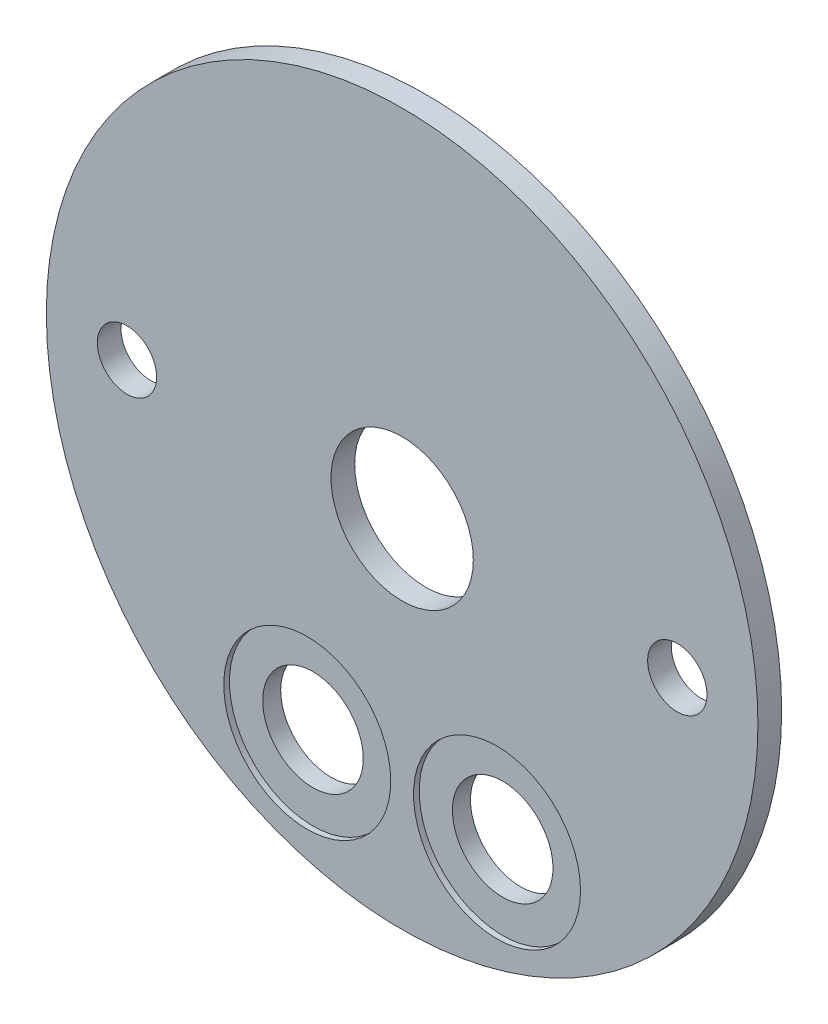
ISO-10303-21;
HEADER;
FILE_DESCRIPTION(('STEP AP214'),'2;1');
FILE_NAME('part.step','',(''),(''),'','','');
FILE_SCHEMA(('AUTOMOTIVE_DESIGN { 1 0 10303 214 1 1 1 1 }'));
ENDSEC;
DATA;
#1=APPLICATION_CONTEXT('core data for automotive mechanical design processes');
#2=APPLICATION_PROTOCOL_DEFINITION('international standard','automotive_design',2000,#1);
#3=PRODUCT_CONTEXT('',#1,'mechanical');
#4=PRODUCT('Part','Part','',(#3));
#5=PRODUCT_RELATED_PRODUCT_CATEGORY('part','',(#4));
#6=PRODUCT_DEFINITION_FORMATION('','',#4);
#7=PRODUCT_DEFINITION_CONTEXT('part definition',#1,'design');
#8=PRODUCT_DEFINITION('design','',#6,#7);
#9=PRODUCT_DEFINITION_SHAPE('','',#8);
#10=(LENGTH_UNIT() NAMED_UNIT(*) SI_UNIT(.MILLI.,.METRE.));
#11=(NAMED_UNIT(*) PLANE_ANGLE_UNIT() SI_UNIT($,.RADIAN.));
#12=(NAMED_UNIT(*) SI_UNIT($,.STERADIAN.) SOLID_ANGLE_UNIT());
#13=UNCERTAINTY_MEASURE_WITH_UNIT(LENGTH_MEASURE(1.E-05),#10,'distance_accuracy_value','');
#14=(GEOMETRIC_REPRESENTATION_CONTEXT(3) GLOBAL_UNCERTAINTY_ASSIGNED_CONTEXT((#13)) GLOBAL_UNIT_ASSIGNED_CONTEXT((#10,
#11,#12)) REPRESENTATION_CONTEXT('',''));
#15=CARTESIAN_POINT('',(0.,0.,0.));
#16=DIRECTION('',(0.,0.,1.));
#17=DIRECTION('',(1.,0.,0.));
#18=AXIS2_PLACEMENT_3D('',#15,#16,#17);
#19=CARTESIAN_POINT('',(-12.7,-31.1667936271924,0.));
#20=DIRECTION('',(0.,0.,1.));
#21=DIRECTION('',(1.,0.,0.));
#22=AXIS2_PLACEMENT_3D('',#19,#20,#21);
#23=CYLINDRICAL_SURFACE('',#22,6.731);
#24=CARTESIAN_POINT('',(-12.7,-31.1667936271924,5.08));
#25=DIRECTION('',(0.,0.,-1.));
#26=DIRECTION('',(-1.,0.,0.));
#27=AXIS2_PLACEMENT_3D('',#24,#25,#26);
#28=CIRCLE('',#27,6.731);
#29=CARTESIAN_POINT('',(-19.431,-31.1667936271924,5.08));
#30=VERTEX_POINT('',#29);
#31=EDGE_CURVE('E82',#30,#30,#28,.F.);
#32=ORIENTED_EDGE('',*,*,#31,.F.);
#33=EDGE_LOOP('',(#32));
#34=FACE_BOUND('',#33,.T.);
#35=CARTESIAN_POINT('',(-12.7,-31.1667936271924,7.493));
#36=DIRECTION('',(0.,0.,1.));
#37=DIRECTION('',(1.,0.,0.));
#38=AXIS2_PLACEMENT_3D('',#35,#36,#37);
#39=CIRCLE('',#38,6.731);
#40=CARTESIAN_POINT('',(-5.969,-31.1667936271924,7.493));
#41=VERTEX_POINT('',#40);
#42=EDGE_CURVE('E38',#41,#41,#39,.F.);
#43=ORIENTED_EDGE('',*,*,#42,.F.);
#44=EDGE_LOOP('',(#43));
#45=FACE_BOUND('',#44,.T.);
#46=ADVANCED_FACE('F34',(#34,#45),#23,.F.);
#47=CARTESIAN_POINT('',(12.7,-31.1667936271924,0.));
#48=DIRECTION('',(0.,0.,1.));
#49=DIRECTION('',(1.,0.,0.));
#50=AXIS2_PLACEMENT_3D('',#47,#48,#49);
#51=CYLINDRICAL_SURFACE('',#50,6.731);
#52=CARTESIAN_POINT('',(12.7,-31.1667936271924,5.08));
#53=DIRECTION('',(0.,0.,-1.));
#54=DIRECTION('',(-1.,0.,0.));
#55=AXIS2_PLACEMENT_3D('',#52,#53,#54);
#56=CIRCLE('',#55,6.731);
#57=CARTESIAN_POINT('',(5.969,-31.1667936271924,5.08));
#58=VERTEX_POINT('',#57);
#59=EDGE_CURVE('E51',#58,#58,#56,.F.);
#60=ORIENTED_EDGE('',*,*,#59,.F.);
#61=EDGE_LOOP('',(#60));
#62=FACE_BOUND('',#61,.T.);
#63=CARTESIAN_POINT('',(12.7,-31.1667936271924,7.493));
#64=DIRECTION('',(0.,0.,1.));
#65=DIRECTION('',(1.,0.,0.));
#66=AXIS2_PLACEMENT_3D('',#63,#64,#65);
#67=CIRCLE('',#66,6.731);
#68=CARTESIAN_POINT('',(19.431,-31.1667936271924,7.493));
#69=VERTEX_POINT('',#68);
#70=EDGE_CURVE('E54',#69,#69,#67,.F.);
#71=ORIENTED_EDGE('',*,*,#70,.F.);
#72=EDGE_LOOP('',(#71));
#73=FACE_BOUND('',#72,.T.);
#74=ADVANCED_FACE('F113',(#62,#73),#51,.F.);
#75=CARTESIAN_POINT('',(0.,0.,0.));
#76=DIRECTION('',(0.,0.,1.));
#77=DIRECTION('',(1.,0.,0.));
#78=AXIS2_PLACEMENT_3D('',#75,#76,#77);
#79=CYLINDRICAL_SURFACE('',#78,9.525);
#80=CARTESIAN_POINT('',(0.,0.,8.255));
#81=DIRECTION('',(0.,0.,1.));
#82=DIRECTION('',(1.,0.,0.));
#83=AXIS2_PLACEMENT_3D('',#80,#81,#82);
#84=CIRCLE('',#83,9.525);
#85=CARTESIAN_POINT('',(9.525,0.,8.255));
#86=VERTEX_POINT('',#85);
#87=EDGE_CURVE('E88',#86,#86,#84,.T.);
#88=ORIENTED_EDGE('',*,*,#87,.T.);
#89=EDGE_LOOP('',(#88));
#90=FACE_BOUND('',#89,.T.);
#91=CARTESIAN_POINT('',(0.,0.,5.08));
#92=DIRECTION('',(0.,0.,-1.));
#93=DIRECTION('',(-1.,0.,0.));
#94=AXIS2_PLACEMENT_3D('',#91,#92,#93);
#95=CIRCLE('',#94,9.525);
#96=CARTESIAN_POINT('',(-9.525,0.,5.08));
#97=VERTEX_POINT('',#96);
#98=EDGE_CURVE('E79',#97,#97,#95,.F.);
#99=ORIENTED_EDGE('',*,*,#98,.F.);
#100=EDGE_LOOP('',(#99));
#101=FACE_BOUND('',#100,.T.);
#102=ADVANCED_FACE('F93',(#90,#101),#79,.F.);
#103=CARTESIAN_POINT('',(36.83,0.,0.));
#104=DIRECTION('',(0.,0.,1.));
#105=DIRECTION('',(1.,0.,0.));
#106=AXIS2_PLACEMENT_3D('',#103,#104,#105);
#107=CYLINDRICAL_SURFACE('',#106,3.96875);
#108=CARTESIAN_POINT('',(36.83,0.,8.255));
#109=DIRECTION('',(0.,0.,1.));
#110=DIRECTION('',(1.,0.,0.));
#111=AXIS2_PLACEMENT_3D('',#108,#109,#110);
#112=CIRCLE('',#111,3.96875);
#113=CARTESIAN_POINT('',(40.79875,0.,8.255));
#114=VERTEX_POINT('',#113);
#115=EDGE_CURVE('E47',#114,#114,#112,.T.);
#116=ORIENTED_EDGE('',*,*,#115,.T.);
#117=EDGE_LOOP('',(#116));
#118=FACE_BOUND('',#117,.T.);
#119=CARTESIAN_POINT('',(36.83,0.,5.08));
#120=DIRECTION('',(0.,0.,-1.));
#121=DIRECTION('',(-1.,0.,0.));
#122=AXIS2_PLACEMENT_3D('',#119,#120,#121);
#123=CIRCLE('',#122,3.96875);
#124=CARTESIAN_POINT('',(32.86125,0.,5.08));
#125=VERTEX_POINT('',#124);
#126=EDGE_CURVE('E76',#125,#125,#123,.F.);
#127=ORIENTED_EDGE('',*,*,#126,.F.);
#128=EDGE_LOOP('',(#127));
#129=FACE_BOUND('',#128,.T.);
#130=ADVANCED_FACE('F124',(#118,#129),#107,.F.);
#131=CARTESIAN_POINT('',(-36.83,0.,0.));
#132=DIRECTION('',(0.,0.,1.));
#133=DIRECTION('',(1.,0.,0.));
#134=AXIS2_PLACEMENT_3D('',#131,#132,#133);
#135=CYLINDRICAL_SURFACE('',#134,3.96875);
#136=CARTESIAN_POINT('',(-36.83,0.,8.255));
#137=DIRECTION('',(0.,0.,1.));
#138=DIRECTION('',(1.,0.,0.));
#139=AXIS2_PLACEMENT_3D('',#136,#137,#138);
#140=CIRCLE('',#139,3.96875);
#141=CARTESIAN_POINT('',(-32.86125,0.,8.255));
#142=VERTEX_POINT('',#141);
#143=EDGE_CURVE('E42',#142,#142,#140,.T.);
#144=ORIENTED_EDGE('',*,*,#143,.T.);
#145=EDGE_LOOP('',(#144));
#146=FACE_BOUND('',#145,.T.);
#147=CARTESIAN_POINT('',(-36.83,0.,5.08));
#148=DIRECTION('',(0.,0.,-1.));
#149=DIRECTION('',(-1.,0.,0.));
#150=AXIS2_PLACEMENT_3D('',#147,#148,#149);
#151=CIRCLE('',#150,3.96875);
#152=CARTESIAN_POINT('',(-40.79875,0.,5.08));
#153=VERTEX_POINT('',#152);
#154=EDGE_CURVE('E53',#153,#153,#151,.F.);
#155=ORIENTED_EDGE('',*,*,#154,.F.);
#156=EDGE_LOOP('',(#155));
#157=FACE_BOUND('',#156,.T.);
#158=ADVANCED_FACE('F107',(#146,#157),#135,.F.);
#159=CARTESIAN_POINT('',(0.,0.,8.255));
#160=DIRECTION('',(0.,0.,-1.));
#161=DIRECTION('',(-1.,0.,0.));
#162=AXIS2_PLACEMENT_3D('',#159,#160,#161);
#163=CYLINDRICAL_SURFACE('',#162,47.625);
#164=CARTESIAN_POINT('',(0.,0.,8.255));
#165=DIRECTION('',(0.,0.,1.));
#166=DIRECTION('',(1.,0.,0.));
#167=AXIS2_PLACEMENT_3D('',#164,#165,#166);
#168=CIRCLE('',#167,47.625);
#169=CARTESIAN_POINT('',(47.625,0.,8.255));
#170=VERTEX_POINT('',#169);
#171=EDGE_CURVE('E10',#170,#170,#168,.T.);
#172=ORIENTED_EDGE('',*,*,#171,.F.);
#173=EDGE_LOOP('',(#172));
#174=FACE_BOUND('',#173,.T.);
#175=CARTESIAN_POINT('',(0.,0.,5.08));
#176=DIRECTION('',(0.,0.,-1.));
#177=DIRECTION('',(-1.,0.,0.));
#178=AXIS2_PLACEMENT_3D('',#175,#176,#177);
#179=CIRCLE('',#178,47.625);
#180=CARTESIAN_POINT('',(-47.625,0.,5.08));
#181=VERTEX_POINT('',#180);
#182=EDGE_CURVE('E85',#181,#181,#179,.T.);
#183=ORIENTED_EDGE('',*,*,#182,.F.);
#184=EDGE_LOOP('',(#183));
#185=FACE_BOUND('',#184,.T.);
#186=ADVANCED_FACE('F36',(#174,#185),#163,.T.);
#187=CARTESIAN_POINT('',(0.,0.,8.255));
#188=DIRECTION('',(0.,0.,1.));
#189=DIRECTION('',(1.,0.,0.));
#190=AXIS2_PLACEMENT_3D('',#187,#188,#189);
#191=PLANE('',#190);
#192=CARTESIAN_POINT('',(-12.7,-31.1667936271924,8.255));
#193=DIRECTION('',(0.,0.,1.));
#194=DIRECTION('',(1.,0.,0.));
#195=AXIS2_PLACEMENT_3D('',#192,#193,#194);
#196=CIRCLE('',#195,11.176);
#197=CARTESIAN_POINT('',(-1.524,-31.1667936271924,8.255));
#198=VERTEX_POINT('',#197);
#199=EDGE_CURVE('E61',#198,#198,#196,.T.);
#200=ORIENTED_EDGE('',*,*,#199,.F.);
#201=EDGE_LOOP('',(#200));
#202=FACE_BOUND('',#201,.T.);
#203=CARTESIAN_POINT('',(12.7,-31.1667936271924,8.255));
#204=DIRECTION('',(0.,0.,1.));
#205=DIRECTION('',(1.,0.,0.));
#206=AXIS2_PLACEMENT_3D('',#203,#204,#205);
#207=CIRCLE('',#206,11.176);
#208=CARTESIAN_POINT('',(23.876,-31.1667936271924,8.255));
#209=VERTEX_POINT('',#208);
#210=EDGE_CURVE('E71',#209,#209,#207,.T.);
#211=ORIENTED_EDGE('',*,*,#210,.F.);
#212=EDGE_LOOP('',(#211));
#213=FACE_BOUND('',#212,.T.);
#214=ORIENTED_EDGE('',*,*,#143,.F.);
#215=EDGE_LOOP('',(#214));
#216=FACE_BOUND('',#215,.T.);
#217=ORIENTED_EDGE('',*,*,#115,.F.);
#218=EDGE_LOOP('',(#217));
#219=FACE_BOUND('',#218,.T.);
#220=ORIENTED_EDGE('',*,*,#87,.F.);
#221=EDGE_LOOP('',(#220));
#222=FACE_BOUND('',#221,.T.);
#223=ORIENTED_EDGE('',*,*,#171,.T.);
#224=EDGE_LOOP('',(#223));
#225=FACE_BOUND('',#224,.T.);
#226=ADVANCED_FACE('F96',(#202,#213,#216,#219,#222,#225),#191,.T.);
#227=CARTESIAN_POINT('',(0.,0.,5.08));
#228=DIRECTION('',(0.,0.,-1.));
#229=DIRECTION('',(-1.,0.,0.));
#230=AXIS2_PLACEMENT_3D('',#227,#228,#229);
#231=PLANE('',#230);
#232=ORIENTED_EDGE('',*,*,#31,.T.);
#233=EDGE_LOOP('',(#232));
#234=FACE_BOUND('',#233,.T.);
#235=ORIENTED_EDGE('',*,*,#98,.T.);
#236=EDGE_LOOP('',(#235));
#237=FACE_BOUND('',#236,.T.);
#238=ORIENTED_EDGE('',*,*,#126,.T.);
#239=EDGE_LOOP('',(#238));
#240=FACE_BOUND('',#239,.T.);
#241=ORIENTED_EDGE('',*,*,#154,.T.);
#242=EDGE_LOOP('',(#241));
#243=FACE_BOUND('',#242,.T.);
#244=ORIENTED_EDGE('',*,*,#59,.T.);
#245=EDGE_LOOP('',(#244));
#246=FACE_BOUND('',#245,.T.);
#247=ORIENTED_EDGE('',*,*,#182,.T.);
#248=EDGE_LOOP('',(#247));
#249=FACE_BOUND('',#248,.T.);
#250=ADVANCED_FACE('F98',(#234,#237,#240,#243,#246,#249),#231,.T.);
#251=CARTESIAN_POINT('',(12.7,-31.1667936271924,7.493));
#252=DIRECTION('',(0.,0.,1.));
#253=DIRECTION('',(1.,0.,0.));
#254=AXIS2_PLACEMENT_3D('',#251,#252,#253);
#255=PLANE('',#254);
#256=CARTESIAN_POINT('',(12.7,-31.1667936271924,7.493));
#257=DIRECTION('',(0.,0.,1.));
#258=DIRECTION('',(1.,0.,0.));
#259=AXIS2_PLACEMENT_3D('',#256,#257,#258);
#260=CIRCLE('',#259,11.176);
#261=CARTESIAN_POINT('',(23.876,-31.1667936271924,7.493));
#262=VERTEX_POINT('',#261);
#263=EDGE_CURVE('E66',#262,#262,#260,.T.);
#264=ORIENTED_EDGE('',*,*,#263,.T.);
#265=EDGE_LOOP('',(#264));
#266=FACE_BOUND('',#265,.T.);
#267=ORIENTED_EDGE('',*,*,#70,.T.);
#268=EDGE_LOOP('',(#267));
#269=FACE_BOUND('',#268,.T.);
#270=ADVANCED_FACE('F104',(#266,#269),#255,.T.);
#271=CARTESIAN_POINT('',(12.7,-31.1667936271924,7.493));
#272=DIRECTION('',(0.,0.,1.));
#273=DIRECTION('',(1.,0.,0.));
#274=AXIS2_PLACEMENT_3D('',#271,#272,#273);
#275=CYLINDRICAL_SURFACE('',#274,11.176);
#276=ORIENTED_EDGE('',*,*,#263,.F.);
#277=EDGE_LOOP('',(#276));
#278=FACE_BOUND('',#277,.T.);
#279=ORIENTED_EDGE('',*,*,#210,.T.);
#280=EDGE_LOOP('',(#279));
#281=FACE_BOUND('',#280,.T.);
#282=ADVANCED_FACE('F132',(#278,#281),#275,.F.);
#283=CARTESIAN_POINT('',(-12.7,-31.1667936271924,7.493));
#284=DIRECTION('',(0.,0.,1.));
#285=DIRECTION('',(1.,0.,0.));
#286=AXIS2_PLACEMENT_3D('',#283,#284,#285);
#287=PLANE('',#286);
#288=CARTESIAN_POINT('',(-12.7,-31.1667936271924,7.493));
#289=DIRECTION('',(0.,0.,1.));
#290=DIRECTION('',(1.,0.,0.));
#291=AXIS2_PLACEMENT_3D('',#288,#289,#290);
#292=CIRCLE('',#291,11.176);
#293=CARTESIAN_POINT('',(-1.524,-31.1667936271924,7.493));
#294=VERTEX_POINT('',#293);
#295=EDGE_CURVE('E56',#294,#294,#292,.T.);
#296=ORIENTED_EDGE('',*,*,#295,.T.);
#297=EDGE_LOOP('',(#296));
#298=FACE_BOUND('',#297,.T.);
#299=ORIENTED_EDGE('',*,*,#42,.T.);
#300=EDGE_LOOP('',(#299));
#301=FACE_BOUND('',#300,.T.);
#302=ADVANCED_FACE('F135',(#298,#301),#287,.T.);
#303=CARTESIAN_POINT('',(-12.7,-31.1667936271924,7.493));
#304=DIRECTION('',(0.,0.,1.));
#305=DIRECTION('',(1.,0.,0.));
#306=AXIS2_PLACEMENT_3D('',#303,#304,#305);
#307=CYLINDRICAL_SURFACE('',#306,11.176);
#308=ORIENTED_EDGE('',*,*,#295,.F.);
#309=EDGE_LOOP('',(#308));
#310=FACE_BOUND('',#309,.T.);
#311=ORIENTED_EDGE('',*,*,#199,.T.);
#312=EDGE_LOOP('',(#311));
#313=FACE_BOUND('',#312,.T.);
#314=ADVANCED_FACE('F140',(#310,#313),#307,.F.);
#315=CLOSED_SHELL('',(#46,#74,#102,#130,#158,#186,#226,#250,#270,#282,#302,#314));
#316=MANIFOLD_SOLID_BREP('B2',#315);
#317=ADVANCED_BREP_SHAPE_REPRESENTATION('',(#18,#316),#14);
#318=SHAPE_DEFINITION_REPRESENTATION(#9,#317);
ENDSEC;
END-ISO-10303-21;
